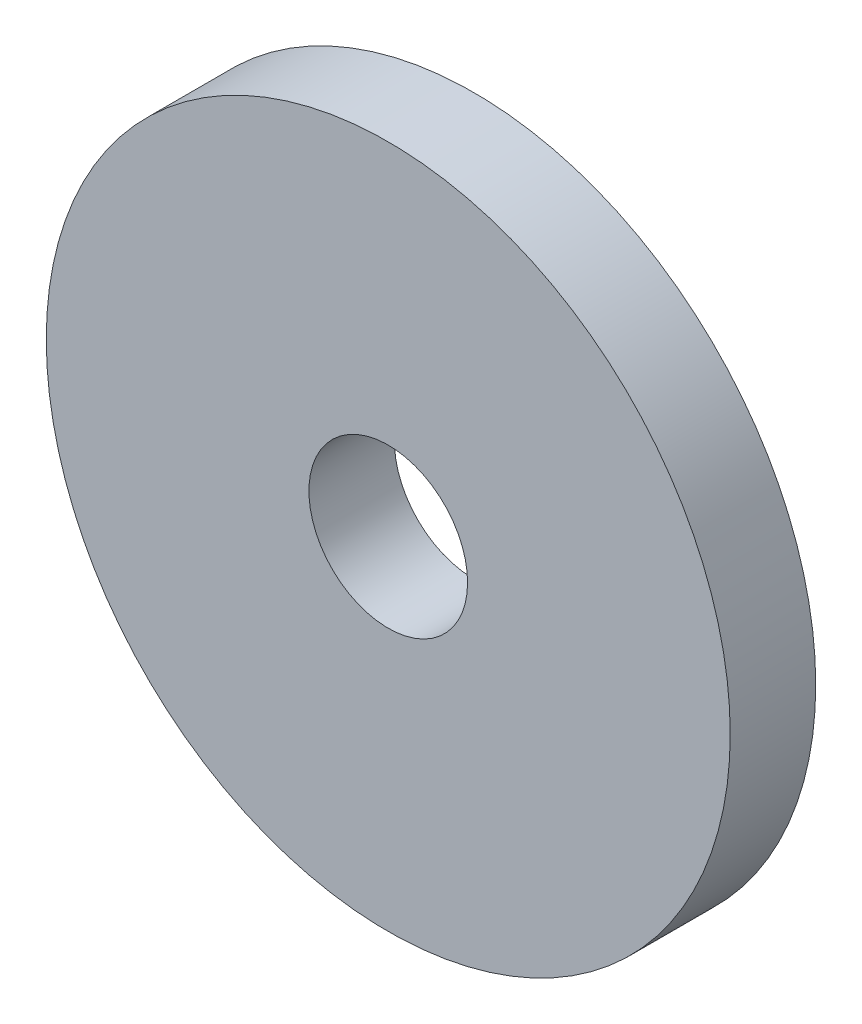
ISO-10303-21;
HEADER;
FILE_DESCRIPTION(('STEP AP214'),'2;1');
FILE_NAME('part.step','',(''),(''),'','','');
FILE_SCHEMA(('AUTOMOTIVE_DESIGN { 1 0 10303 214 1 1 1 1 }'));
ENDSEC;
DATA;
#1=APPLICATION_CONTEXT('core data for automotive mechanical design processes');
#2=APPLICATION_PROTOCOL_DEFINITION('international standard','automotive_design',2000,#1);
#3=PRODUCT_CONTEXT('',#1,'mechanical');
#4=PRODUCT('Part','Part','',(#3));
#5=PRODUCT_RELATED_PRODUCT_CATEGORY('part','',(#4));
#6=PRODUCT_DEFINITION_FORMATION('','',#4);
#7=PRODUCT_DEFINITION_CONTEXT('part definition',#1,'design');
#8=PRODUCT_DEFINITION('design','',#6,#7);
#9=PRODUCT_DEFINITION_SHAPE('','',#8);
#10=(LENGTH_UNIT() NAMED_UNIT(*) SI_UNIT(.MILLI.,.METRE.));
#11=(NAMED_UNIT(*) PLANE_ANGLE_UNIT() SI_UNIT($,.RADIAN.));
#12=(NAMED_UNIT(*) SI_UNIT($,.STERADIAN.) SOLID_ANGLE_UNIT());
#13=UNCERTAINTY_MEASURE_WITH_UNIT(LENGTH_MEASURE(1.E-05),#10,'distance_accuracy_value','');
#14=(GEOMETRIC_REPRESENTATION_CONTEXT(3) GLOBAL_UNCERTAINTY_ASSIGNED_CONTEXT((#13)) GLOBAL_UNIT_ASSIGNED_CONTEXT((#10,
#11,#12)) REPRESENTATION_CONTEXT('',''));
#15=CARTESIAN_POINT('',(0.,0.,0.));
#16=DIRECTION('',(0.,0.,1.));
#17=DIRECTION('',(1.,0.,0.));
#18=AXIS2_PLACEMENT_3D('',#15,#16,#17);
#19=CARTESIAN_POINT('',(0.,0.,1.5875));
#20=DIRECTION('',(0.,0.,1.));
#21=DIRECTION('',(1.,0.,0.));
#22=AXIS2_PLACEMENT_3D('',#19,#20,#21);
#23=PLANE('',#22);
#24=CARTESIAN_POINT('',(0.,0.,1.5875));
#25=DIRECTION('',(0.,0.,1.));
#26=DIRECTION('',(1.,0.,0.));
#27=AXIS2_PLACEMENT_3D('',#24,#25,#26);
#28=CIRCLE('',#27,6.35);
#29=CARTESIAN_POINT('',(6.35,0.,1.5875));
#30=VERTEX_POINT('',#29);
#31=EDGE_CURVE('E10',#30,#30,#28,.T.);
#32=ORIENTED_EDGE('',*,*,#31,.T.);
#33=EDGE_LOOP('',(#32));
#34=FACE_BOUND('',#33,.T.);
#35=CARTESIAN_POINT('',(0.,0.,1.5875));
#36=DIRECTION('',(0.,0.,1.));
#37=DIRECTION('',(1.,0.,0.));
#38=AXIS2_PLACEMENT_3D('',#35,#36,#37);
#39=CIRCLE('',#38,1.4732);
#40=CARTESIAN_POINT('',(1.4732,0.,1.5875));
#41=VERTEX_POINT('',#40);
#42=EDGE_CURVE('E42',#41,#41,#39,.T.);
#43=ORIENTED_EDGE('',*,*,#42,.F.);
#44=EDGE_LOOP('',(#43));
#45=FACE_BOUND('',#44,.T.);
#46=ADVANCED_FACE('F31',(#34,#45),#23,.T.);
#47=CARTESIAN_POINT('',(0.,0.,0.));
#48=DIRECTION('',(0.,0.,1.));
#49=DIRECTION('',(1.,0.,0.));
#50=AXIS2_PLACEMENT_3D('',#47,#48,#49);
#51=PLANE('',#50);
#52=CARTESIAN_POINT('',(0.,0.,0.));
#53=DIRECTION('',(0.,0.,1.));
#54=DIRECTION('',(1.,0.,0.));
#55=AXIS2_PLACEMENT_3D('',#52,#53,#54);
#56=CIRCLE('',#55,6.35);
#57=CARTESIAN_POINT('',(6.35,0.,0.));
#58=VERTEX_POINT('',#57);
#59=EDGE_CURVE('E35',#58,#58,#56,.T.);
#60=ORIENTED_EDGE('',*,*,#59,.F.);
#61=EDGE_LOOP('',(#60));
#62=FACE_BOUND('',#61,.T.);
#63=CARTESIAN_POINT('',(0.,0.,0.));
#64=DIRECTION('',(0.,0.,1.));
#65=DIRECTION('',(1.,0.,0.));
#66=AXIS2_PLACEMENT_3D('',#63,#64,#65);
#67=CIRCLE('',#66,1.4732);
#68=CARTESIAN_POINT('',(1.4732,0.,0.));
#69=VERTEX_POINT('',#68);
#70=EDGE_CURVE('E44',#69,#69,#67,.T.);
#71=ORIENTED_EDGE('',*,*,#70,.T.);
#72=EDGE_LOOP('',(#71));
#73=FACE_BOUND('',#72,.T.);
#74=ADVANCED_FACE('F54',(#62,#73),#51,.F.);
#75=CARTESIAN_POINT('',(0.,0.,1.5875));
#76=DIRECTION('',(0.,0.,-1.));
#77=DIRECTION('',(-1.,0.,0.));
#78=AXIS2_PLACEMENT_3D('',#75,#76,#77);
#79=CYLINDRICAL_SURFACE('',#78,6.35);
#80=ORIENTED_EDGE('',*,*,#31,.F.);
#81=EDGE_LOOP('',(#80));
#82=FACE_BOUND('',#81,.T.);
#83=ORIENTED_EDGE('',*,*,#59,.T.);
#84=EDGE_LOOP('',(#83));
#85=FACE_BOUND('',#84,.T.);
#86=ADVANCED_FACE('F33',(#82,#85),#79,.T.);
#87=CARTESIAN_POINT('',(0.,0.,1.5875));
#88=DIRECTION('',(0.,0.,-1.));
#89=DIRECTION('',(-1.,0.,0.));
#90=AXIS2_PLACEMENT_3D('',#87,#88,#89);
#91=CYLINDRICAL_SURFACE('',#90,1.4732);
#92=ORIENTED_EDGE('',*,*,#42,.T.);
#93=EDGE_LOOP('',(#92));
#94=FACE_BOUND('',#93,.T.);
#95=ORIENTED_EDGE('',*,*,#70,.F.);
#96=EDGE_LOOP('',(#95));
#97=FACE_BOUND('',#96,.T.);
#98=ADVANCED_FACE('F50',(#94,#97),#91,.F.);
#99=CLOSED_SHELL('',(#46,#74,#86,#98));
#100=MANIFOLD_SOLID_BREP('B2',#99);
#101=ADVANCED_BREP_SHAPE_REPRESENTATION('',(#18,#100),#14);
#102=SHAPE_DEFINITION_REPRESENTATION(#9,#101);
ENDSEC;
END-ISO-10303-21;
